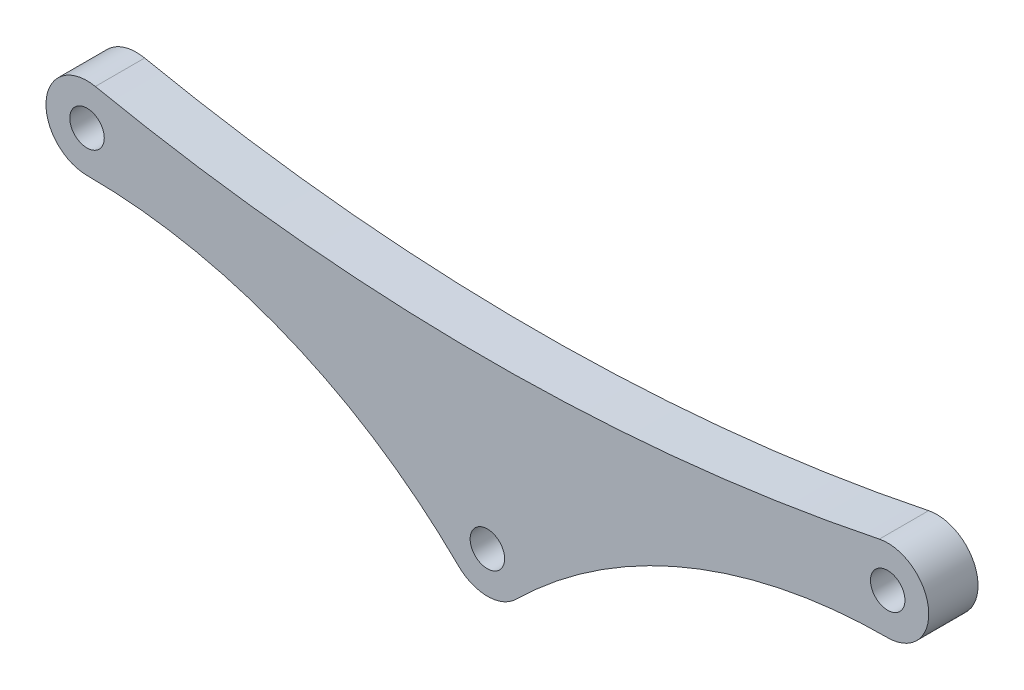
ISO-10303-21;
HEADER;
FILE_DESCRIPTION(('STEP AP214'),'2;1');
FILE_NAME('part.step','',(''),(''),'','','');
FILE_SCHEMA(('AUTOMOTIVE_DESIGN { 1 0 10303 214 1 1 1 1 }'));
ENDSEC;
DATA;
#1=APPLICATION_CONTEXT('core data for automotive mechanical design processes');
#2=APPLICATION_PROTOCOL_DEFINITION('international standard','automotive_design',2000,#1);
#3=PRODUCT_CONTEXT('',#1,'mechanical');
#4=PRODUCT('Part','Part','',(#3));
#5=PRODUCT_RELATED_PRODUCT_CATEGORY('part','',(#4));
#6=PRODUCT_DEFINITION_FORMATION('','',#4);
#7=PRODUCT_DEFINITION_CONTEXT('part definition',#1,'design');
#8=PRODUCT_DEFINITION('design','',#6,#7);
#9=PRODUCT_DEFINITION_SHAPE('','',#8);
#10=(LENGTH_UNIT() NAMED_UNIT(*) SI_UNIT(.MILLI.,.METRE.));
#11=(NAMED_UNIT(*) PLANE_ANGLE_UNIT() SI_UNIT($,.RADIAN.));
#12=(NAMED_UNIT(*) SI_UNIT($,.STERADIAN.) SOLID_ANGLE_UNIT());
#13=UNCERTAINTY_MEASURE_WITH_UNIT(LENGTH_MEASURE(1.E-05),#10,'distance_accuracy_value','');
#14=(GEOMETRIC_REPRESENTATION_CONTEXT(3) GLOBAL_UNCERTAINTY_ASSIGNED_CONTEXT((#13)) GLOBAL_UNIT_ASSIGNED_CONTEXT((#10,
#11,#12)) REPRESENTATION_CONTEXT('',''));
#15=CARTESIAN_POINT('',(0.,0.,0.));
#16=DIRECTION('',(0.,0.,1.));
#17=DIRECTION('',(1.,0.,0.));
#18=AXIS2_PLACEMENT_3D('',#15,#16,#17);
#19=CARTESIAN_POINT('',(24.375,137.578125,6.));
#20=DIRECTION('',(0.,0.,1.));
#21=DIRECTION('',(1.,0.,0.));
#22=AXIS2_PLACEMENT_3D('',#19,#20,#21);
#23=PLANE('',#22);
#24=CARTESIAN_POINT('',(-48.75,20.,6.));
#25=DIRECTION('',(0.,0.,1.));
#26=DIRECTION('',(1.,0.,0.));
#27=AXIS2_PLACEMENT_3D('',#24,#25,#26);
#28=CIRCLE('',#27,2.1);
#29=CARTESIAN_POINT('',(-46.65,20.,6.));
#30=VERTEX_POINT('',#29);
#31=EDGE_CURVE('E187',#30,#30,#28,.T.);
#32=ORIENTED_EDGE('',*,*,#31,.F.);
#33=EDGE_LOOP('',(#32));
#34=FACE_BOUND('',#33,.T.);
#35=CARTESIAN_POINT('',(0.,255.15625,6.));
#36=DIRECTION('',(0.,0.,-1.));
#37=DIRECTION('',(1.,0.,0.));
#38=AXIS2_PLACEMENT_3D('',#35,#36,#37);
#39=CIRCLE('',#38,235.15625);
#40=CARTESIAN_POINT('',(47.7350357839948,24.8959011060508,6.));
#41=VERTEX_POINT('',#40);
#42=CARTESIAN_POINT('',(-47.7350357839948,24.8959011060508,6.));
#43=VERTEX_POINT('',#42);
#44=EDGE_CURVE('E131',#41,#43,#39,.T.);
#45=ORIENTED_EDGE('',*,*,#44,.T.);
#46=CARTESIAN_POINT('',(-48.75,20.,6.));
#47=DIRECTION('',(0.,0.,1.));
#48=DIRECTION('',(1.,0.,0.));
#49=AXIS2_PLACEMENT_3D('',#46,#47,#48);
#50=CIRCLE('',#49,5.);
#51=CARTESIAN_POINT('',(-48.75,15.,6.));
#52=VERTEX_POINT('',#51);
#53=EDGE_CURVE('E89',#43,#52,#50,.T.);
#54=ORIENTED_EDGE('',*,*,#53,.T.);
#55=CARTESIAN_POINT('',(-48.75,-49.4140625,6.));
#56=DIRECTION('',(0.,0.,-1.));
#57=DIRECTION('',(1.,0.,0.));
#58=AXIS2_PLACEMENT_3D('',#55,#56,#57);
#59=CIRCLE('',#58,64.4140625);
#60=CARTESIAN_POINT('',(-3.51153629713,-3.55936972425436,6.));
#61=VERTEX_POINT('',#60);
#62=EDGE_CURVE('E102',#52,#61,#59,.T.);
#63=ORIENTED_EDGE('',*,*,#62,.T.);
#64=CARTESIAN_POINT('',(0.,0.,6.));
#65=DIRECTION('',(0.,0.,1.));
#66=DIRECTION('',(1.,0.,0.));
#67=AXIS2_PLACEMENT_3D('',#64,#65,#66);
#68=CIRCLE('',#67,5.00000000000001);
#69=CARTESIAN_POINT('',(3.51153629713,-3.55936972425436,6.));
#70=VERTEX_POINT('',#69);
#71=EDGE_CURVE('E96',#61,#70,#68,.T.);
#72=ORIENTED_EDGE('',*,*,#71,.T.);
#73=CARTESIAN_POINT('',(48.75,-49.4140625,6.));
#74=DIRECTION('',(0.,0.,-1.));
#75=DIRECTION('',(-1.,0.,0.));
#76=AXIS2_PLACEMENT_3D('',#73,#74,#75);
#77=CIRCLE('',#76,64.4140625);
#78=CARTESIAN_POINT('',(48.75,15.,6.));
#79=VERTEX_POINT('',#78);
#80=EDGE_CURVE('E100',#70,#79,#77,.T.);
#81=ORIENTED_EDGE('',*,*,#80,.T.);
#82=CARTESIAN_POINT('',(48.75,20.,6.));
#83=DIRECTION('',(0.,0.,1.));
#84=DIRECTION('',(-1.,0.,0.));
#85=AXIS2_PLACEMENT_3D('',#82,#83,#84);
#86=CIRCLE('',#85,5.);
#87=EDGE_CURVE('E52',#79,#41,#86,.T.);
#88=ORIENTED_EDGE('',*,*,#87,.T.);
#89=EDGE_LOOP('',(#45,#54,#63,#72,#81,#88));
#90=FACE_BOUND('',#89,.T.);
#91=CARTESIAN_POINT('',(0.,0.,6.));
#92=DIRECTION('',(0.,0.,1.));
#93=DIRECTION('',(1.,0.,0.));
#94=AXIS2_PLACEMENT_3D('',#91,#92,#93);
#95=CIRCLE('',#94,2.1);
#96=CARTESIAN_POINT('',(2.1,0.,6.));
#97=VERTEX_POINT('',#96);
#98=EDGE_CURVE('E124',#97,#97,#95,.T.);
#99=ORIENTED_EDGE('',*,*,#98,.F.);
#100=EDGE_LOOP('',(#99));
#101=FACE_BOUND('',#100,.T.);
#102=CARTESIAN_POINT('',(48.75,20.,6.));
#103=DIRECTION('',(0.,0.,1.));
#104=DIRECTION('',(-1.,0.,0.));
#105=AXIS2_PLACEMENT_3D('',#102,#103,#104);
#106=CIRCLE('',#105,2.1);
#107=CARTESIAN_POINT('',(46.65,20.,6.));
#108=VERTEX_POINT('',#107);
#109=EDGE_CURVE('E178',#108,#108,#106,.T.);
#110=ORIENTED_EDGE('',*,*,#109,.F.);
#111=EDGE_LOOP('',(#110));
#112=FACE_BOUND('',#111,.T.);
#113=ADVANCED_FACE('F35',(#34,#90,#101,#112),#23,.T.);
#114=CARTESIAN_POINT('',(24.375,137.578125,0.));
#115=DIRECTION('',(0.,0.,1.));
#116=DIRECTION('',(1.,0.,0.));
#117=AXIS2_PLACEMENT_3D('',#114,#115,#116);
#118=PLANE('',#117);
#119=CARTESIAN_POINT('',(-48.75,20.,0.));
#120=DIRECTION('',(0.,0.,1.));
#121=DIRECTION('',(1.,0.,0.));
#122=AXIS2_PLACEMENT_3D('',#119,#120,#121);
#123=CIRCLE('',#122,2.1);
#124=CARTESIAN_POINT('',(-46.65,20.,0.));
#125=VERTEX_POINT('',#124);
#126=EDGE_CURVE('E184',#125,#125,#123,.T.);
#127=ORIENTED_EDGE('',*,*,#126,.T.);
#128=EDGE_LOOP('',(#127));
#129=FACE_BOUND('',#128,.T.);
#130=CARTESIAN_POINT('',(0.,255.15625,0.));
#131=DIRECTION('',(0.,0.,-1.));
#132=DIRECTION('',(1.,0.,0.));
#133=AXIS2_PLACEMENT_3D('',#130,#131,#132);
#134=CIRCLE('',#133,235.15625);
#135=CARTESIAN_POINT('',(47.7350357839948,24.8959011060508,0.));
#136=VERTEX_POINT('',#135);
#137=CARTESIAN_POINT('',(-47.7350357839948,24.8959011060508,0.));
#138=VERTEX_POINT('',#137);
#139=EDGE_CURVE('E120',#136,#138,#134,.T.);
#140=ORIENTED_EDGE('',*,*,#139,.F.);
#141=CARTESIAN_POINT('',(48.75,20.,0.));
#142=DIRECTION('',(0.,0.,1.));
#143=DIRECTION('',(-1.,0.,0.));
#144=AXIS2_PLACEMENT_3D('',#141,#142,#143);
#145=CIRCLE('',#144,5.);
#146=CARTESIAN_POINT('',(48.75,15.,0.));
#147=VERTEX_POINT('',#146);
#148=EDGE_CURVE('E81',#147,#136,#145,.T.);
#149=ORIENTED_EDGE('',*,*,#148,.F.);
#150=CARTESIAN_POINT('',(48.75,-49.4140625,0.));
#151=DIRECTION('',(0.,0.,-1.));
#152=DIRECTION('',(-1.,0.,0.));
#153=AXIS2_PLACEMENT_3D('',#150,#151,#152);
#154=CIRCLE('',#153,64.4140625);
#155=CARTESIAN_POINT('',(3.51153629713,-3.55936972425436,0.));
#156=VERTEX_POINT('',#155);
#157=EDGE_CURVE('E75',#156,#147,#154,.T.);
#158=ORIENTED_EDGE('',*,*,#157,.F.);
#159=CARTESIAN_POINT('',(0.,0.,0.));
#160=DIRECTION('',(0.,0.,1.));
#161=DIRECTION('',(1.,0.,0.));
#162=AXIS2_PLACEMENT_3D('',#159,#160,#161);
#163=CIRCLE('',#162,5.00000000000001);
#164=CARTESIAN_POINT('',(-3.51153629713,-3.55936972425436,0.));
#165=VERTEX_POINT('',#164);
#166=EDGE_CURVE('E110',#165,#156,#163,.T.);
#167=ORIENTED_EDGE('',*,*,#166,.F.);
#168=CARTESIAN_POINT('',(-48.75,-49.4140625,0.));
#169=DIRECTION('',(0.,0.,-1.));
#170=DIRECTION('',(1.,0.,0.));
#171=AXIS2_PLACEMENT_3D('',#168,#169,#170);
#172=CIRCLE('',#171,64.4140625);
#173=CARTESIAN_POINT('',(-48.75,15.,0.));
#174=VERTEX_POINT('',#173);
#175=EDGE_CURVE('E126',#174,#165,#172,.T.);
#176=ORIENTED_EDGE('',*,*,#175,.F.);
#177=CARTESIAN_POINT('',(-48.75,20.,0.));
#178=DIRECTION('',(0.,0.,1.));
#179=DIRECTION('',(1.,0.,0.));
#180=AXIS2_PLACEMENT_3D('',#177,#178,#179);
#181=CIRCLE('',#180,5.);
#182=EDGE_CURVE('E123',#138,#174,#181,.T.);
#183=ORIENTED_EDGE('',*,*,#182,.F.);
#184=EDGE_LOOP('',(#140,#149,#158,#167,#176,#183));
#185=FACE_BOUND('',#184,.T.);
#186=CARTESIAN_POINT('',(0.,0.,0.));
#187=DIRECTION('',(0.,0.,1.));
#188=DIRECTION('',(1.,0.,0.));
#189=AXIS2_PLACEMENT_3D('',#186,#187,#188);
#190=CIRCLE('',#189,2.1);
#191=CARTESIAN_POINT('',(2.1,0.,0.));
#192=VERTEX_POINT('',#191);
#193=EDGE_CURVE('E190',#192,#192,#190,.T.);
#194=ORIENTED_EDGE('',*,*,#193,.T.);
#195=EDGE_LOOP('',(#194));
#196=FACE_BOUND('',#195,.T.);
#197=CARTESIAN_POINT('',(48.75,20.,0.));
#198=DIRECTION('',(0.,0.,1.));
#199=DIRECTION('',(-1.,0.,0.));
#200=AXIS2_PLACEMENT_3D('',#197,#198,#199);
#201=CIRCLE('',#200,2.1);
#202=CARTESIAN_POINT('',(46.65,20.,0.));
#203=VERTEX_POINT('',#202);
#204=EDGE_CURVE('E181',#203,#203,#201,.T.);
#205=ORIENTED_EDGE('',*,*,#204,.T.);
#206=EDGE_LOOP('',(#205));
#207=FACE_BOUND('',#206,.T.);
#208=ADVANCED_FACE('F140',(#129,#185,#196,#207),#118,.F.);
#209=CARTESIAN_POINT('',(0.,255.15625,6.));
#210=DIRECTION('',(0.,0.,-1.));
#211=DIRECTION('',(-1.,0.,0.));
#212=AXIS2_PLACEMENT_3D('',#209,#210,#211);
#213=CYLINDRICAL_SURFACE('',#212,235.15625);
#214=ORIENTED_EDGE('',*,*,#139,.T.);
#215=DIRECTION('',(0.,0.,-1.));
#216=VECTOR('',#215,1.);
#217=CARTESIAN_POINT('',(-47.7350357839948,24.8959011060508,6.));
#218=LINE('',#217,#216);
#219=EDGE_CURVE('E11',#43,#138,#218,.T.);
#220=ORIENTED_EDGE('',*,*,#219,.F.);
#221=ORIENTED_EDGE('',*,*,#44,.F.);
#222=DIRECTION('',(0.,0.,-1.));
#223=VECTOR('',#222,1.);
#224=CARTESIAN_POINT('',(47.7350357839948,24.8959011060508,6.));
#225=LINE('',#224,#223);
#226=EDGE_CURVE('E116',#41,#136,#225,.T.);
#227=ORIENTED_EDGE('',*,*,#226,.T.);
#228=EDGE_LOOP('',(#214,#220,#221,#227));
#229=FACE_BOUND('',#228,.T.);
#230=ADVANCED_FACE('F37',(#229),#213,.F.);
#231=CARTESIAN_POINT('',(-48.75,20.,6.));
#232=DIRECTION('',(0.,0.,-1.));
#233=DIRECTION('',(-1.,0.,0.));
#234=AXIS2_PLACEMENT_3D('',#231,#232,#233);
#235=CYLINDRICAL_SURFACE('',#234,5.);
#236=ORIENTED_EDGE('',*,*,#182,.T.);
#237=DIRECTION('',(0.,0.,-1.));
#238=VECTOR('',#237,1.);
#239=CARTESIAN_POINT('',(-48.75,15.,6.));
#240=LINE('',#239,#238);
#241=EDGE_CURVE('E44',#52,#174,#240,.T.);
#242=ORIENTED_EDGE('',*,*,#241,.F.);
#243=ORIENTED_EDGE('',*,*,#53,.F.);
#244=ORIENTED_EDGE('',*,*,#219,.T.);
#245=EDGE_LOOP('',(#236,#242,#243,#244));
#246=FACE_BOUND('',#245,.T.);
#247=ADVANCED_FACE('F239',(#246),#235,.T.);
#248=CARTESIAN_POINT('',(-48.75,-49.4140625,6.));
#249=DIRECTION('',(0.,0.,-1.));
#250=DIRECTION('',(-1.,0.,0.));
#251=AXIS2_PLACEMENT_3D('',#248,#249,#250);
#252=CYLINDRICAL_SURFACE('',#251,64.4140625);
#253=ORIENTED_EDGE('',*,*,#175,.T.);
#254=DIRECTION('',(0.,0.,-1.));
#255=VECTOR('',#254,1.);
#256=CARTESIAN_POINT('',(-3.51153629713,-3.55936972425436,6.));
#257=LINE('',#256,#255);
#258=EDGE_CURVE('E111',#61,#165,#257,.T.);
#259=ORIENTED_EDGE('',*,*,#258,.F.);
#260=ORIENTED_EDGE('',*,*,#62,.F.);
#261=ORIENTED_EDGE('',*,*,#241,.T.);
#262=EDGE_LOOP('',(#253,#259,#260,#261));
#263=FACE_BOUND('',#262,.T.);
#264=ADVANCED_FACE('F137',(#263),#252,.F.);
#265=CARTESIAN_POINT('',(0.,0.,6.));
#266=DIRECTION('',(0.,0.,-1.));
#267=DIRECTION('',(-1.,0.,0.));
#268=AXIS2_PLACEMENT_3D('',#265,#266,#267);
#269=CYLINDRICAL_SURFACE('',#268,5.00000000000001);
#270=ORIENTED_EDGE('',*,*,#166,.T.);
#271=DIRECTION('',(0.,0.,-1.));
#272=VECTOR('',#271,1.);
#273=CARTESIAN_POINT('',(3.51153629713,-3.55936972425436,6.));
#274=LINE('',#273,#272);
#275=EDGE_CURVE('E107',#70,#156,#274,.T.);
#276=ORIENTED_EDGE('',*,*,#275,.F.);
#277=ORIENTED_EDGE('',*,*,#71,.F.);
#278=ORIENTED_EDGE('',*,*,#258,.T.);
#279=EDGE_LOOP('',(#270,#276,#277,#278));
#280=FACE_BOUND('',#279,.T.);
#281=ADVANCED_FACE('F108',(#280),#269,.T.);
#282=CARTESIAN_POINT('',(48.75,-49.4140625,6.));
#283=DIRECTION('',(0.,0.,-1.));
#284=DIRECTION('',(-1.,0.,0.));
#285=AXIS2_PLACEMENT_3D('',#282,#283,#284);
#286=CYLINDRICAL_SURFACE('',#285,64.4140625);
#287=ORIENTED_EDGE('',*,*,#157,.T.);
#288=DIRECTION('',(0.,0.,-1.));
#289=VECTOR('',#288,1.);
#290=CARTESIAN_POINT('',(48.75,15.,6.));
#291=LINE('',#290,#289);
#292=EDGE_CURVE('E112',#79,#147,#291,.T.);
#293=ORIENTED_EDGE('',*,*,#292,.F.);
#294=ORIENTED_EDGE('',*,*,#80,.F.);
#295=ORIENTED_EDGE('',*,*,#275,.T.);
#296=EDGE_LOOP('',(#287,#293,#294,#295));
#297=FACE_BOUND('',#296,.T.);
#298=ADVANCED_FACE('F114',(#297),#286,.F.);
#299=CARTESIAN_POINT('',(48.75,20.,6.));
#300=DIRECTION('',(0.,0.,-1.));
#301=DIRECTION('',(-1.,0.,0.));
#302=AXIS2_PLACEMENT_3D('',#299,#300,#301);
#303=CYLINDRICAL_SURFACE('',#302,5.);
#304=ORIENTED_EDGE('',*,*,#148,.T.);
#305=ORIENTED_EDGE('',*,*,#226,.F.);
#306=ORIENTED_EDGE('',*,*,#87,.F.);
#307=ORIENTED_EDGE('',*,*,#292,.T.);
#308=EDGE_LOOP('',(#304,#305,#306,#307));
#309=FACE_BOUND('',#308,.T.);
#310=ADVANCED_FACE('F145',(#309),#303,.T.);
#311=CARTESIAN_POINT('',(0.,0.,6.));
#312=DIRECTION('',(0.,0.,-1.));
#313=DIRECTION('',(-1.,0.,0.));
#314=AXIS2_PLACEMENT_3D('',#311,#312,#313);
#315=CYLINDRICAL_SURFACE('',#314,2.1);
#316=ORIENTED_EDGE('',*,*,#98,.T.);
#317=EDGE_LOOP('',(#316));
#318=FACE_BOUND('',#317,.T.);
#319=ORIENTED_EDGE('',*,*,#193,.F.);
#320=EDGE_LOOP('',(#319));
#321=FACE_BOUND('',#320,.T.);
#322=ADVANCED_FACE('F147',(#318,#321),#315,.F.);
#323=CARTESIAN_POINT('',(-48.75,20.,6.));
#324=DIRECTION('',(0.,0.,-1.));
#325=DIRECTION('',(-1.,0.,0.));
#326=AXIS2_PLACEMENT_3D('',#323,#324,#325);
#327=CYLINDRICAL_SURFACE('',#326,2.1);
#328=ORIENTED_EDGE('',*,*,#31,.T.);
#329=EDGE_LOOP('',(#328));
#330=FACE_BOUND('',#329,.T.);
#331=ORIENTED_EDGE('',*,*,#126,.F.);
#332=EDGE_LOOP('',(#331));
#333=FACE_BOUND('',#332,.T.);
#334=ADVANCED_FACE('F153',(#330,#333),#327,.F.);
#335=CARTESIAN_POINT('',(48.75,20.,6.));
#336=DIRECTION('',(0.,0.,-1.));
#337=DIRECTION('',(-1.,0.,0.));
#338=AXIS2_PLACEMENT_3D('',#335,#336,#337);
#339=CYLINDRICAL_SURFACE('',#338,2.1);
#340=ORIENTED_EDGE('',*,*,#109,.T.);
#341=EDGE_LOOP('',(#340));
#342=FACE_BOUND('',#341,.T.);
#343=ORIENTED_EDGE('',*,*,#204,.F.);
#344=EDGE_LOOP('',(#343));
#345=FACE_BOUND('',#344,.T.);
#346=ADVANCED_FACE('F169',(#342,#345),#339,.F.);
#347=CLOSED_SHELL('',(#113,#208,#230,#247,#264,#281,#298,#310,#322,#334,#346));
#348=MANIFOLD_SOLID_BREP('B2',#347);
#349=ADVANCED_BREP_SHAPE_REPRESENTATION('',(#18,#348),#14);
#350=SHAPE_DEFINITION_REPRESENTATION(#9,#349);
ENDSEC;
END-ISO-10303-21;
